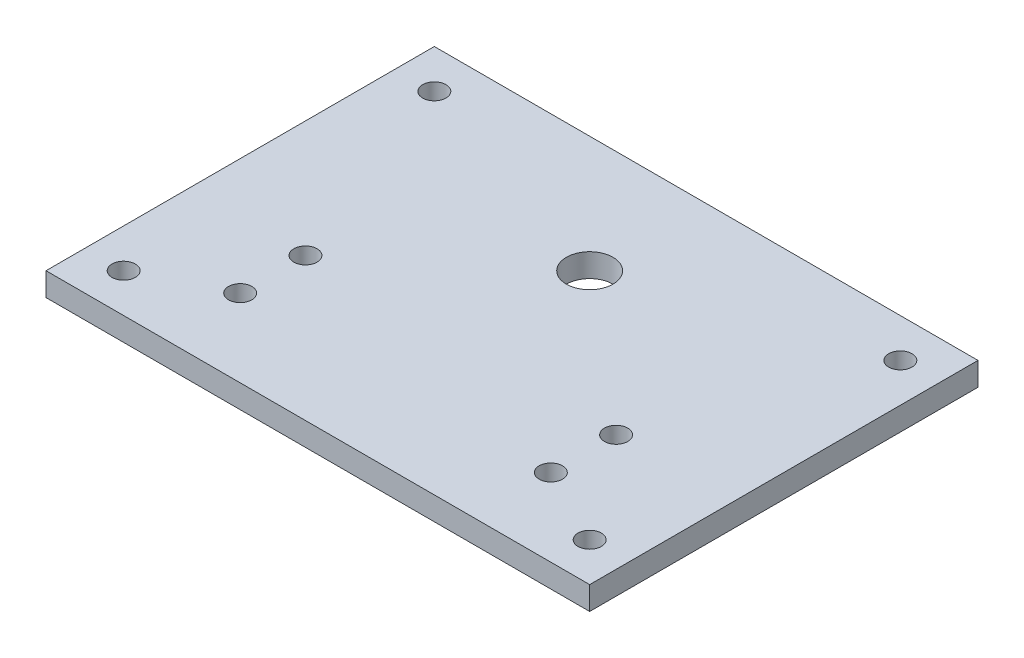
ISO-10303-21;
HEADER;
FILE_DESCRIPTION(('STEP AP214'),'2;1');
FILE_NAME('part.step','',(''),(''),'','','');
FILE_SCHEMA(('AUTOMOTIVE_DESIGN { 1 0 10303 214 1 1 1 1 }'));
ENDSEC;
DATA;
#1=APPLICATION_CONTEXT('core data for automotive mechanical design processes');
#2=APPLICATION_PROTOCOL_DEFINITION('international standard','automotive_design',2000,#1);
#3=PRODUCT_CONTEXT('',#1,'mechanical');
#4=PRODUCT('Part','Part','',(#3));
#5=PRODUCT_RELATED_PRODUCT_CATEGORY('part','',(#4));
#6=PRODUCT_DEFINITION_FORMATION('','',#4);
#7=PRODUCT_DEFINITION_CONTEXT('part definition',#1,'design');
#8=PRODUCT_DEFINITION('design','',#6,#7);
#9=PRODUCT_DEFINITION_SHAPE('','',#8);
#10=(LENGTH_UNIT() NAMED_UNIT(*) SI_UNIT(.MILLI.,.METRE.));
#11=(NAMED_UNIT(*) PLANE_ANGLE_UNIT() SI_UNIT($,.RADIAN.));
#12=(NAMED_UNIT(*) SI_UNIT($,.STERADIAN.) SOLID_ANGLE_UNIT());
#13=UNCERTAINTY_MEASURE_WITH_UNIT(LENGTH_MEASURE(1.E-05),#10,'distance_accuracy_value','');
#14=(GEOMETRIC_REPRESENTATION_CONTEXT(3) GLOBAL_UNCERTAINTY_ASSIGNED_CONTEXT((#13)) GLOBAL_UNIT_ASSIGNED_CONTEXT((#10,
#11,#12)) REPRESENTATION_CONTEXT('',''));
#15=CARTESIAN_POINT('',(0.,0.,0.));
#16=DIRECTION('',(0.,0.,1.));
#17=DIRECTION('',(1.,0.,0.));
#18=AXIS2_PLACEMENT_3D('',#15,#16,#17);
#19=CARTESIAN_POINT('',(70.,205.,132.65));
#20=DIRECTION('',(0.,0.,-1.));
#21=DIRECTION('',(-1.,0.,0.));
#22=AXIS2_PLACEMENT_3D('',#19,#20,#21);
#23=PLANE('',#22);
#24=DIRECTION('',(-1.,0.,0.));
#25=VECTOR('',#24,1.);
#26=CARTESIAN_POINT('',(70.,205.,132.65));
#27=LINE('',#26,#25);
#28=CARTESIAN_POINT('',(70.,205.,132.65));
#29=VERTEX_POINT('',#28);
#30=CARTESIAN_POINT('',(-70.,205.,132.65));
#31=VERTEX_POINT('',#30);
#32=EDGE_CURVE('E104',#29,#31,#27,.T.);
#33=ORIENTED_EDGE('',*,*,#32,.T.);
#34=DIRECTION('',(0.,-1.,0.));
#35=VECTOR('',#34,1.);
#36=CARTESIAN_POINT('',(-70.,205.,132.65));
#37=LINE('',#36,#35);
#38=CARTESIAN_POINT('',(-70.,199.,132.65));
#39=VERTEX_POINT('',#38);
#40=EDGE_CURVE('E98',#31,#39,#37,.T.);
#41=ORIENTED_EDGE('',*,*,#40,.T.);
#42=DIRECTION('',(-1.,0.,0.));
#43=VECTOR('',#42,1.);
#44=CARTESIAN_POINT('',(70.,199.,132.65));
#45=LINE('',#44,#43);
#46=CARTESIAN_POINT('',(70.,199.,132.65));
#47=VERTEX_POINT('',#46);
#48=EDGE_CURVE('E11',#47,#39,#45,.T.);
#49=ORIENTED_EDGE('',*,*,#48,.F.);
#50=DIRECTION('',(0.,-1.,0.));
#51=VECTOR('',#50,1.);
#52=CARTESIAN_POINT('',(70.,205.,132.65));
#53=LINE('',#52,#51);
#54=EDGE_CURVE('E120',#29,#47,#53,.T.);
#55=ORIENTED_EDGE('',*,*,#54,.F.);
#56=EDGE_LOOP('',(#33,#41,#49,#55));
#57=FACE_BOUND('',#56,.T.);
#58=ADVANCED_FACE('F45',(#57),#23,.F.);
#59=CARTESIAN_POINT('',(70.,199.,132.65));
#60=DIRECTION('',(0.,1.,0.));
#61=DIRECTION('',(0.,0.,1.));
#62=AXIS2_PLACEMENT_3D('',#59,#60,#61);
#63=PLANE('',#62);
#64=CARTESIAN_POINT('',(-60.,199.,122.65));
#65=DIRECTION('',(0.,1.,0.));
#66=DIRECTION('',(0.,0.,1.));
#67=AXIS2_PLACEMENT_3D('',#64,#65,#66);
#68=CIRCLE('',#67,3.00000000000001);
#69=CARTESIAN_POINT('',(-60.,199.,125.65));
#70=VERTEX_POINT('',#69);
#71=EDGE_CURVE('E163',#70,#70,#68,.F.);
#72=ORIENTED_EDGE('',*,*,#71,.F.);
#73=EDGE_LOOP('',(#72));
#74=FACE_BOUND('',#73,.T.);
#75=CARTESIAN_POINT('',(60.,199.,122.65));
#76=DIRECTION('',(0.,1.,0.));
#77=DIRECTION('',(0.,0.,1.));
#78=AXIS2_PLACEMENT_3D('',#75,#76,#77);
#79=CIRCLE('',#78,3.);
#80=CARTESIAN_POINT('',(60.,199.,125.65));
#81=VERTEX_POINT('',#80);
#82=EDGE_CURVE('E167',#81,#81,#79,.F.);
#83=ORIENTED_EDGE('',*,*,#82,.F.);
#84=EDGE_LOOP('',(#83));
#85=FACE_BOUND('',#84,.T.);
#86=CARTESIAN_POINT('',(60.,199.,42.65));
#87=DIRECTION('',(0.,1.,0.));
#88=DIRECTION('',(0.,0.,1.));
#89=AXIS2_PLACEMENT_3D('',#86,#87,#88);
#90=CIRCLE('',#89,2.99999999999999);
#91=CARTESIAN_POINT('',(60.,199.,45.65));
#92=VERTEX_POINT('',#91);
#93=EDGE_CURVE('E171',#92,#92,#90,.F.);
#94=ORIENTED_EDGE('',*,*,#93,.F.);
#95=EDGE_LOOP('',(#94));
#96=FACE_BOUND('',#95,.T.);
#97=CARTESIAN_POINT('',(-60.,199.,42.65));
#98=DIRECTION('',(0.,1.,0.));
#99=DIRECTION('',(0.,0.,1.));
#100=AXIS2_PLACEMENT_3D('',#97,#98,#99);
#101=CIRCLE('',#100,2.99999999999999);
#102=CARTESIAN_POINT('',(-60.,199.,45.65));
#103=VERTEX_POINT('',#102);
#104=EDGE_CURVE('E175',#103,#103,#101,.F.);
#105=ORIENTED_EDGE('',*,*,#104,.F.);
#106=EDGE_LOOP('',(#105));
#107=FACE_BOUND('',#106,.T.);
#108=CARTESIAN_POINT('',(0.,199.,62.65));
#109=DIRECTION('',(0.,1.,0.));
#110=DIRECTION('',(0.,0.,1.));
#111=AXIS2_PLACEMENT_3D('',#108,#109,#110);
#112=CIRCLE('',#111,6.);
#113=CARTESIAN_POINT('',(0.,199.,56.65));
#114=VERTEX_POINT('',#113);
#115=EDGE_CURVE('E106',#114,#114,#112,.F.);
#116=ORIENTED_EDGE('',*,*,#115,.F.);
#117=EDGE_LOOP('',(#116));
#118=FACE_BOUND('',#117,.T.);
#119=CARTESIAN_POINT('',(-40.,199.,112.65));
#120=DIRECTION('',(0.,1.,0.));
#121=DIRECTION('',(0.,0.,1.));
#122=AXIS2_PLACEMENT_3D('',#119,#120,#121);
#123=CIRCLE('',#122,3.);
#124=CARTESIAN_POINT('',(-40.,199.,109.65));
#125=VERTEX_POINT('',#124);
#126=EDGE_CURVE('E111',#125,#125,#123,.F.);
#127=ORIENTED_EDGE('',*,*,#126,.F.);
#128=EDGE_LOOP('',(#127));
#129=FACE_BOUND('',#128,.T.);
#130=CARTESIAN_POINT('',(-40.,199.,95.8393194373977));
#131=DIRECTION('',(0.,1.,0.));
#132=DIRECTION('',(0.,0.,1.));
#133=AXIS2_PLACEMENT_3D('',#130,#131,#132);
#134=CIRCLE('',#133,3.);
#135=CARTESIAN_POINT('',(-40.,199.,92.8393194373977));
#136=VERTEX_POINT('',#135);
#137=EDGE_CURVE('E184',#136,#136,#134,.F.);
#138=ORIENTED_EDGE('',*,*,#137,.F.);
#139=EDGE_LOOP('',(#138));
#140=FACE_BOUND('',#139,.T.);
#141=CARTESIAN_POINT('',(40.,199.,95.8393194373977));
#142=DIRECTION('',(0.,1.,0.));
#143=DIRECTION('',(0.,0.,1.));
#144=AXIS2_PLACEMENT_3D('',#141,#142,#143);
#145=CIRCLE('',#144,3.);
#146=CARTESIAN_POINT('',(40.,199.,92.8393194373977));
#147=VERTEX_POINT('',#146);
#148=EDGE_CURVE('E188',#147,#147,#145,.F.);
#149=ORIENTED_EDGE('',*,*,#148,.F.);
#150=EDGE_LOOP('',(#149));
#151=FACE_BOUND('',#150,.T.);
#152=CARTESIAN_POINT('',(40.,199.,112.65));
#153=DIRECTION('',(0.,1.,0.));
#154=DIRECTION('',(0.,0.,1.));
#155=AXIS2_PLACEMENT_3D('',#152,#153,#154);
#156=CIRCLE('',#155,3.);
#157=CARTESIAN_POINT('',(40.,199.,109.65));
#158=VERTEX_POINT('',#157);
#159=EDGE_CURVE('E191',#158,#158,#156,.F.);
#160=ORIENTED_EDGE('',*,*,#159,.F.);
#161=EDGE_LOOP('',(#160));
#162=FACE_BOUND('',#161,.T.);
#163=ORIENTED_EDGE('',*,*,#48,.T.);
#164=DIRECTION('',(0.,0.,-1.));
#165=VECTOR('',#164,1.);
#166=CARTESIAN_POINT('',(-70.,199.,132.65));
#167=LINE('',#166,#165);
#168=CARTESIAN_POINT('',(-70.,199.,32.65));
#169=VERTEX_POINT('',#168);
#170=EDGE_CURVE('E88',#39,#169,#167,.T.);
#171=ORIENTED_EDGE('',*,*,#170,.T.);
#172=DIRECTION('',(-1.,0.,0.));
#173=VECTOR('',#172,1.);
#174=CARTESIAN_POINT('',(70.,199.,32.65));
#175=LINE('',#174,#173);
#176=CARTESIAN_POINT('',(70.,199.,32.65));
#177=VERTEX_POINT('',#176);
#178=EDGE_CURVE('E53',#177,#169,#175,.T.);
#179=ORIENTED_EDGE('',*,*,#178,.F.);
#180=DIRECTION('',(0.,0.,-1.));
#181=VECTOR('',#180,1.);
#182=CARTESIAN_POINT('',(70.,199.,132.65));
#183=LINE('',#182,#181);
#184=EDGE_CURVE('E89',#47,#177,#183,.T.);
#185=ORIENTED_EDGE('',*,*,#184,.F.);
#186=EDGE_LOOP('',(#163,#171,#179,#185));
#187=FACE_BOUND('',#186,.T.);
#188=ADVANCED_FACE('F86',(#74,#85,#96,#107,#118,#129,#140,#151,#162,#187),#63,.F.);
#189=CARTESIAN_POINT('',(70.,205.,32.65));
#190=DIRECTION('',(0.,0.,1.));
#191=DIRECTION('',(1.,0.,0.));
#192=AXIS2_PLACEMENT_3D('',#189,#190,#191);
#193=PLANE('',#192);
#194=ORIENTED_EDGE('',*,*,#178,.T.);
#195=DIRECTION('',(0.,1.,0.));
#196=VECTOR('',#195,1.);
#197=CARTESIAN_POINT('',(-70.,205.,32.65));
#198=LINE('',#197,#196);
#199=CARTESIAN_POINT('',(-70.,205.,32.65));
#200=VERTEX_POINT('',#199);
#201=EDGE_CURVE('E101',#169,#200,#198,.T.);
#202=ORIENTED_EDGE('',*,*,#201,.T.);
#203=DIRECTION('',(-1.,0.,0.));
#204=VECTOR('',#203,1.);
#205=CARTESIAN_POINT('',(70.,205.,32.65));
#206=LINE('',#205,#204);
#207=CARTESIAN_POINT('',(70.,205.,32.65));
#208=VERTEX_POINT('',#207);
#209=EDGE_CURVE('E131',#208,#200,#206,.T.);
#210=ORIENTED_EDGE('',*,*,#209,.F.);
#211=DIRECTION('',(0.,1.,0.));
#212=VECTOR('',#211,1.);
#213=CARTESIAN_POINT('',(70.,205.,32.65));
#214=LINE('',#213,#212);
#215=EDGE_CURVE('E65',#177,#208,#214,.T.);
#216=ORIENTED_EDGE('',*,*,#215,.F.);
#217=EDGE_LOOP('',(#194,#202,#210,#216));
#218=FACE_BOUND('',#217,.T.);
#219=ADVANCED_FACE('F136',(#218),#193,.F.);
#220=CARTESIAN_POINT('',(70.,205.,132.65));
#221=DIRECTION('',(0.,-1.,0.));
#222=DIRECTION('',(0.,0.,-1.));
#223=AXIS2_PLACEMENT_3D('',#220,#221,#222);
#224=PLANE('',#223);
#225=CARTESIAN_POINT('',(-60.,205.,122.65));
#226=DIRECTION('',(0.,-1.,0.));
#227=DIRECTION('',(0.,0.,-1.));
#228=AXIS2_PLACEMENT_3D('',#225,#226,#227);
#229=CIRCLE('',#228,3.00000000000001);
#230=CARTESIAN_POINT('',(-60.,205.,119.65));
#231=VERTEX_POINT('',#230);
#232=EDGE_CURVE('E278',#231,#231,#229,.T.);
#233=ORIENTED_EDGE('',*,*,#232,.T.);
#234=EDGE_LOOP('',(#233));
#235=FACE_BOUND('',#234,.T.);
#236=CARTESIAN_POINT('',(60.,205.,122.65));
#237=DIRECTION('',(0.,-1.,0.));
#238=DIRECTION('',(0.,0.,-1.));
#239=AXIS2_PLACEMENT_3D('',#236,#237,#238);
#240=CIRCLE('',#239,3.);
#241=CARTESIAN_POINT('',(60.,205.,119.65));
#242=VERTEX_POINT('',#241);
#243=EDGE_CURVE('E282',#242,#242,#240,.T.);
#244=ORIENTED_EDGE('',*,*,#243,.T.);
#245=EDGE_LOOP('',(#244));
#246=FACE_BOUND('',#245,.T.);
#247=CARTESIAN_POINT('',(60.,205.,42.65));
#248=DIRECTION('',(0.,-1.,0.));
#249=DIRECTION('',(0.,0.,-1.));
#250=AXIS2_PLACEMENT_3D('',#247,#248,#249);
#251=CIRCLE('',#250,2.99999999999999);
#252=CARTESIAN_POINT('',(60.,205.,39.6500000000001));
#253=VERTEX_POINT('',#252);
#254=EDGE_CURVE('E277',#253,#253,#251,.T.);
#255=ORIENTED_EDGE('',*,*,#254,.T.);
#256=EDGE_LOOP('',(#255));
#257=FACE_BOUND('',#256,.T.);
#258=CARTESIAN_POINT('',(-60.,205.,42.65));
#259=DIRECTION('',(0.,-1.,0.));
#260=DIRECTION('',(0.,0.,-1.));
#261=AXIS2_PLACEMENT_3D('',#258,#259,#260);
#262=CIRCLE('',#261,2.99999999999999);
#263=CARTESIAN_POINT('',(-60.,205.,39.65));
#264=VERTEX_POINT('',#263);
#265=EDGE_CURVE('E273',#264,#264,#262,.T.);
#266=ORIENTED_EDGE('',*,*,#265,.T.);
#267=EDGE_LOOP('',(#266));
#268=FACE_BOUND('',#267,.T.);
#269=CARTESIAN_POINT('',(0.,205.,62.65));
#270=DIRECTION('',(0.,-1.,0.));
#271=DIRECTION('',(0.,0.,-1.));
#272=AXIS2_PLACEMENT_3D('',#269,#270,#271);
#273=CIRCLE('',#272,6.);
#274=CARTESIAN_POINT('',(0.,205.,56.65));
#275=VERTEX_POINT('',#274);
#276=EDGE_CURVE('E194',#275,#275,#273,.T.);
#277=ORIENTED_EDGE('',*,*,#276,.T.);
#278=EDGE_LOOP('',(#277));
#279=FACE_BOUND('',#278,.T.);
#280=CARTESIAN_POINT('',(-40.,205.,112.65));
#281=DIRECTION('',(0.,-1.,0.));
#282=DIRECTION('',(0.,0.,-1.));
#283=AXIS2_PLACEMENT_3D('',#280,#281,#282);
#284=CIRCLE('',#283,3.);
#285=CARTESIAN_POINT('',(-40.,205.,109.65));
#286=VERTEX_POINT('',#285);
#287=EDGE_CURVE('E201',#286,#286,#284,.T.);
#288=ORIENTED_EDGE('',*,*,#287,.T.);
#289=EDGE_LOOP('',(#288));
#290=FACE_BOUND('',#289,.T.);
#291=CARTESIAN_POINT('',(-40.,205.,95.8393194373977));
#292=DIRECTION('',(0.,-1.,0.));
#293=DIRECTION('',(0.,0.,-1.));
#294=AXIS2_PLACEMENT_3D('',#291,#292,#293);
#295=CIRCLE('',#294,3.);
#296=CARTESIAN_POINT('',(-40.,205.,92.8393194373977));
#297=VERTEX_POINT('',#296);
#298=EDGE_CURVE('E245',#297,#297,#295,.T.);
#299=ORIENTED_EDGE('',*,*,#298,.T.);
#300=EDGE_LOOP('',(#299));
#301=FACE_BOUND('',#300,.T.);
#302=CARTESIAN_POINT('',(40.,205.,95.8393194373977));
#303=DIRECTION('',(0.,-1.,0.));
#304=DIRECTION('',(0.,0.,-1.));
#305=AXIS2_PLACEMENT_3D('',#302,#303,#304);
#306=CIRCLE('',#305,3.);
#307=CARTESIAN_POINT('',(40.,205.,92.8393194373977));
#308=VERTEX_POINT('',#307);
#309=EDGE_CURVE('E240',#308,#308,#306,.T.);
#310=ORIENTED_EDGE('',*,*,#309,.T.);
#311=EDGE_LOOP('',(#310));
#312=FACE_BOUND('',#311,.T.);
#313=CARTESIAN_POINT('',(40.,205.,112.65));
#314=DIRECTION('',(0.,-1.,0.));
#315=DIRECTION('',(0.,0.,-1.));
#316=AXIS2_PLACEMENT_3D('',#313,#314,#315);
#317=CIRCLE('',#316,3.);
#318=CARTESIAN_POINT('',(40.,205.,109.65));
#319=VERTEX_POINT('',#318);
#320=EDGE_CURVE('E204',#319,#319,#317,.T.);
#321=ORIENTED_EDGE('',*,*,#320,.T.);
#322=EDGE_LOOP('',(#321));
#323=FACE_BOUND('',#322,.T.);
#324=ORIENTED_EDGE('',*,*,#209,.T.);
#325=DIRECTION('',(0.,0.,1.));
#326=VECTOR('',#325,1.);
#327=CARTESIAN_POINT('',(-70.,205.,132.65));
#328=LINE('',#327,#326);
#329=EDGE_CURVE('E117',#200,#31,#328,.T.);
#330=ORIENTED_EDGE('',*,*,#329,.T.);
#331=ORIENTED_EDGE('',*,*,#32,.F.);
#332=DIRECTION('',(0.,0.,1.));
#333=VECTOR('',#332,1.);
#334=CARTESIAN_POINT('',(70.,205.,132.65));
#335=LINE('',#334,#333);
#336=EDGE_CURVE('E60',#208,#29,#335,.T.);
#337=ORIENTED_EDGE('',*,*,#336,.F.);
#338=EDGE_LOOP('',(#324,#330,#331,#337));
#339=FACE_BOUND('',#338,.T.);
#340=ADVANCED_FACE('F138',(#235,#246,#257,#268,#279,#290,#301,#312,#323,#339),#224,.F.);
#341=CARTESIAN_POINT('',(70.,0.,0.));
#342=DIRECTION('',(1.,0.,0.));
#343=DIRECTION('',(0.,0.,-1.));
#344=AXIS2_PLACEMENT_3D('',#341,#342,#343);
#345=PLANE('',#344);
#346=ORIENTED_EDGE('',*,*,#54,.T.);
#347=ORIENTED_EDGE('',*,*,#184,.T.);
#348=ORIENTED_EDGE('',*,*,#215,.T.);
#349=ORIENTED_EDGE('',*,*,#336,.T.);
#350=EDGE_LOOP('',(#346,#347,#348,#349));
#351=FACE_BOUND('',#350,.T.);
#352=ADVANCED_FACE('F139',(#351),#345,.T.);
#353=CARTESIAN_POINT('',(-70.,0.,0.));
#354=DIRECTION('',(1.,0.,0.));
#355=DIRECTION('',(0.,0.,-1.));
#356=AXIS2_PLACEMENT_3D('',#353,#354,#355);
#357=PLANE('',#356);
#358=ORIENTED_EDGE('',*,*,#40,.F.);
#359=ORIENTED_EDGE('',*,*,#329,.F.);
#360=ORIENTED_EDGE('',*,*,#201,.F.);
#361=ORIENTED_EDGE('',*,*,#170,.F.);
#362=EDGE_LOOP('',(#358,#359,#360,#361));
#363=FACE_BOUND('',#362,.T.);
#364=ADVANCED_FACE('F96',(#363),#357,.F.);
#365=CARTESIAN_POINT('',(40.,221.970562748477,112.65));
#366=DIRECTION('',(0.,-1.,0.));
#367=DIRECTION('',(0.,0.,-1.));
#368=AXIS2_PLACEMENT_3D('',#365,#366,#367);
#369=CYLINDRICAL_SURFACE('',#368,3.);
#370=CARTESIAN_POINT('',(40.,205.,109.65));
#371=CARTESIAN_POINT('',(40.,204.9375,109.65));
#372=CARTESIAN_POINT('',(40.,204.875,109.65));
#373=CARTESIAN_POINT('',(40.,204.75,109.65));
#374=CARTESIAN_POINT('',(40.,204.6875,109.65));
#375=CARTESIAN_POINT('',(40.,204.5625,109.65));
#376=CARTESIAN_POINT('',(40.,204.5,109.65));
#377=CARTESIAN_POINT('',(40.,204.375,109.65));
#378=CARTESIAN_POINT('',(40.,204.3125,109.65));
#379=CARTESIAN_POINT('',(40.,204.1875,109.65));
#380=CARTESIAN_POINT('',(40.,204.125,109.65));
#381=CARTESIAN_POINT('',(40.,204.,109.65));
#382=CARTESIAN_POINT('',(40.,203.9375,109.65));
#383=CARTESIAN_POINT('',(40.,203.8125,109.65));
#384=CARTESIAN_POINT('',(40.,203.75,109.65));
#385=CARTESIAN_POINT('',(40.,203.625,109.65));
#386=CARTESIAN_POINT('',(40.,203.5625,109.65));
#387=CARTESIAN_POINT('',(40.,203.4375,109.65));
#388=CARTESIAN_POINT('',(40.,203.375,109.65));
#389=CARTESIAN_POINT('',(40.,203.25,109.65));
#390=CARTESIAN_POINT('',(40.,203.1875,109.65));
#391=CARTESIAN_POINT('',(40.,203.0625,109.65));
#392=CARTESIAN_POINT('',(40.,203.,109.65));
#393=CARTESIAN_POINT('',(40.,202.875,109.65));
#394=CARTESIAN_POINT('',(40.,202.8125,109.65));
#395=CARTESIAN_POINT('',(40.,202.6875,109.65));
#396=CARTESIAN_POINT('',(40.,202.625,109.65));
#397=CARTESIAN_POINT('',(40.,202.5,109.65));
#398=CARTESIAN_POINT('',(40.,202.4375,109.65));
#399=CARTESIAN_POINT('',(40.,202.3125,109.65));
#400=CARTESIAN_POINT('',(40.,202.25,109.65));
#401=CARTESIAN_POINT('',(40.,202.125,109.65));
#402=CARTESIAN_POINT('',(40.,202.0625,109.65));
#403=CARTESIAN_POINT('',(40.,201.9375,109.65));
#404=CARTESIAN_POINT('',(40.,201.875,109.65));
#405=CARTESIAN_POINT('',(40.,201.75,109.65));
#406=CARTESIAN_POINT('',(40.,201.6875,109.65));
#407=CARTESIAN_POINT('',(40.,201.5625,109.65));
#408=CARTESIAN_POINT('',(40.,201.5,109.65));
#409=CARTESIAN_POINT('',(40.,201.375,109.65));
#410=CARTESIAN_POINT('',(40.,201.3125,109.65));
#411=CARTESIAN_POINT('',(40.,201.1875,109.65));
#412=CARTESIAN_POINT('',(40.,201.125,109.65));
#413=CARTESIAN_POINT('',(40.,201.,109.65));
#414=CARTESIAN_POINT('',(40.,200.9375,109.65));
#415=CARTESIAN_POINT('',(40.,200.8125,109.65));
#416=CARTESIAN_POINT('',(40.,200.75,109.65));
#417=CARTESIAN_POINT('',(40.,200.625,109.65));
#418=CARTESIAN_POINT('',(40.,200.5625,109.65));
#419=CARTESIAN_POINT('',(40.,200.4375,109.65));
#420=CARTESIAN_POINT('',(40.,200.375,109.65));
#421=CARTESIAN_POINT('',(40.,200.25,109.65));
#422=CARTESIAN_POINT('',(40.,200.1875,109.65));
#423=CARTESIAN_POINT('',(40.,200.0625,109.65));
#424=CARTESIAN_POINT('',(40.,200.,109.65));
#425=CARTESIAN_POINT('',(40.,199.875,109.65));
#426=CARTESIAN_POINT('',(40.,199.8125,109.65));
#427=CARTESIAN_POINT('',(40.,199.6875,109.65));
#428=CARTESIAN_POINT('',(40.,199.625,109.65));
#429=CARTESIAN_POINT('',(40.,199.5,109.65));
#430=CARTESIAN_POINT('',(40.,199.4375,109.65));
#431=CARTESIAN_POINT('',(40.,199.3125,109.65));
#432=CARTESIAN_POINT('',(40.,199.25,109.65));
#433=CARTESIAN_POINT('',(40.,199.125,109.65));
#434=CARTESIAN_POINT('',(40.,199.0625,109.65));
#435=CARTESIAN_POINT('',(40.,199.,109.65));
#436=B_SPLINE_CURVE_WITH_KNOTS('',3,(#370,#371,#372,#373,#374,#375,#376,#377,#378,#379,#380,
#381,#382,#383,#384,#385,#386,#387,#388,#389,#390,#391,#392,#393,#394,#395,#396,#397,#398,#399,
#400,#401,#402,#403,#404,#405,#406,#407,#408,#409,#410,#411,#412,#413,#414,#415,#416,#417,#418,
#419,#420,#421,#422,#423,#424,#425,#426,#427,#428,#429,#430,#431,#432,#433,#434,#435),
.UNSPECIFIED.,.F.,.F.,(4,2,2,2,2,2,2,2,2,2,2,2,2,2,2,2,2,2,2,2,2,2,2,2,2,2,2,2,2,2,2,2,4),(0.,
0.187500000000007,0.375000000000014,0.562500000000021,0.750000000000001,0.937500000000008,
1.12500000000001,1.31250000000002,1.50000000000003,1.68750000000004,1.87500000000002,
2.06250000000002,2.25000000000003,2.43750000000004,2.62500000000002,2.81250000000002,
3.00000000000003,3.18750000000004,3.37500000000004,3.56250000000002,3.75000000000003,
3.93750000000004,4.12500000000005,4.31250000000002,4.50000000000003,4.68750000000004,
4.87500000000005,5.06250000000005,5.25000000000006,5.43750000000004,5.62500000000005,
5.81250000000005,6.00000000000006),.UNSPECIFIED.);
#437=EDGE_CURVE('BSEAM146',#319,#158,#436,.T.);
#438=ORIENTED_EDGE('',*,*,#320,.F.);
#439=ORIENTED_EDGE('',*,*,#159,.T.);
#440=ORIENTED_EDGE('',*,*,#437,.T.);
#441=ORIENTED_EDGE('',*,*,#437,.F.);
#442=EDGE_LOOP('',(#438,#440,#439,#441));
#443=FACE_BOUND('',#442,.T.);
#444=ADVANCED_FACE('F146',(#443),#369,.F.);
#445=CARTESIAN_POINT('',(40.,221.970562748477,95.8393194373977));
#446=DIRECTION('',(0.,-1.,0.));
#447=DIRECTION('',(0.,0.,-1.));
#448=AXIS2_PLACEMENT_3D('',#445,#446,#447);
#449=CYLINDRICAL_SURFACE('',#448,3.);
#450=CARTESIAN_POINT('',(40.,205.,92.8393194373977));
#451=CARTESIAN_POINT('',(40.,204.9375,92.8393194373977));
#452=CARTESIAN_POINT('',(40.,204.875,92.8393194373977));
#453=CARTESIAN_POINT('',(40.,204.75,92.8393194373977));
#454=CARTESIAN_POINT('',(40.,204.6875,92.8393194373977));
#455=CARTESIAN_POINT('',(40.,204.5625,92.8393194373977));
#456=CARTESIAN_POINT('',(40.,204.5,92.8393194373977));
#457=CARTESIAN_POINT('',(40.,204.375,92.8393194373977));
#458=CARTESIAN_POINT('',(40.,204.3125,92.8393194373977));
#459=CARTESIAN_POINT('',(40.,204.1875,92.8393194373977));
#460=CARTESIAN_POINT('',(40.,204.125,92.8393194373977));
#461=CARTESIAN_POINT('',(40.,204.,92.8393194373977));
#462=CARTESIAN_POINT('',(40.,203.9375,92.8393194373977));
#463=CARTESIAN_POINT('',(40.,203.8125,92.8393194373977));
#464=CARTESIAN_POINT('',(40.,203.75,92.8393194373977));
#465=CARTESIAN_POINT('',(40.,203.625,92.8393194373977));
#466=CARTESIAN_POINT('',(40.,203.5625,92.8393194373977));
#467=CARTESIAN_POINT('',(40.,203.4375,92.8393194373977));
#468=CARTESIAN_POINT('',(40.,203.375,92.8393194373977));
#469=CARTESIAN_POINT('',(40.,203.25,92.8393194373977));
#470=CARTESIAN_POINT('',(40.,203.1875,92.8393194373977));
#471=CARTESIAN_POINT('',(40.,203.0625,92.8393194373977));
#472=CARTESIAN_POINT('',(40.,203.,92.8393194373977));
#473=CARTESIAN_POINT('',(40.,202.875,92.8393194373977));
#474=CARTESIAN_POINT('',(40.,202.8125,92.8393194373977));
#475=CARTESIAN_POINT('',(40.,202.6875,92.8393194373977));
#476=CARTESIAN_POINT('',(40.,202.625,92.8393194373977));
#477=CARTESIAN_POINT('',(40.,202.5,92.8393194373977));
#478=CARTESIAN_POINT('',(40.,202.4375,92.8393194373977));
#479=CARTESIAN_POINT('',(40.,202.3125,92.8393194373977));
#480=CARTESIAN_POINT('',(40.,202.25,92.8393194373977));
#481=CARTESIAN_POINT('',(40.,202.125,92.8393194373977));
#482=CARTESIAN_POINT('',(40.,202.0625,92.8393194373977));
#483=CARTESIAN_POINT('',(40.,201.9375,92.8393194373977));
#484=CARTESIAN_POINT('',(40.,201.875,92.8393194373977));
#485=CARTESIAN_POINT('',(40.,201.75,92.8393194373977));
#486=CARTESIAN_POINT('',(40.,201.6875,92.8393194373977));
#487=CARTESIAN_POINT('',(40.,201.5625,92.8393194373977));
#488=CARTESIAN_POINT('',(40.,201.5,92.8393194373977));
#489=CARTESIAN_POINT('',(40.,201.375,92.8393194373977));
#490=CARTESIAN_POINT('',(40.,201.3125,92.8393194373977));
#491=CARTESIAN_POINT('',(40.,201.1875,92.8393194373977));
#492=CARTESIAN_POINT('',(40.,201.125,92.8393194373977));
#493=CARTESIAN_POINT('',(40.,201.,92.8393194373977));
#494=CARTESIAN_POINT('',(40.,200.9375,92.8393194373977));
#495=CARTESIAN_POINT('',(40.,200.8125,92.8393194373977));
#496=CARTESIAN_POINT('',(40.,200.75,92.8393194373977));
#497=CARTESIAN_POINT('',(40.,200.625,92.8393194373977));
#498=CARTESIAN_POINT('',(40.,200.5625,92.8393194373977));
#499=CARTESIAN_POINT('',(40.,200.4375,92.8393194373977));
#500=CARTESIAN_POINT('',(40.,200.375,92.8393194373977));
#501=CARTESIAN_POINT('',(40.,200.25,92.8393194373977));
#502=CARTESIAN_POINT('',(40.,200.1875,92.8393194373977));
#503=CARTESIAN_POINT('',(40.,200.0625,92.8393194373977));
#504=CARTESIAN_POINT('',(40.,200.,92.8393194373977));
#505=CARTESIAN_POINT('',(40.,199.875,92.8393194373977));
#506=CARTESIAN_POINT('',(40.,199.8125,92.8393194373977));
#507=CARTESIAN_POINT('',(40.,199.6875,92.8393194373977));
#508=CARTESIAN_POINT('',(40.,199.625,92.8393194373977));
#509=CARTESIAN_POINT('',(40.,199.5,92.8393194373977));
#510=CARTESIAN_POINT('',(40.,199.4375,92.8393194373977));
#511=CARTESIAN_POINT('',(40.,199.3125,92.8393194373977));
#512=CARTESIAN_POINT('',(40.,199.25,92.8393194373977));
#513=CARTESIAN_POINT('',(40.,199.125,92.8393194373977));
#514=CARTESIAN_POINT('',(40.,199.0625,92.8393194373977));
#515=CARTESIAN_POINT('',(40.,199.,92.8393194373977));
#516=B_SPLINE_CURVE_WITH_KNOTS('',3,(#450,#451,#452,#453,#454,#455,#456,#457,#458,#459,#460,
#461,#462,#463,#464,#465,#466,#467,#468,#469,#470,#471,#472,#473,#474,#475,#476,#477,#478,#479,
#480,#481,#482,#483,#484,#485,#486,#487,#488,#489,#490,#491,#492,#493,#494,#495,#496,#497,#498,
#499,#500,#501,#502,#503,#504,#505,#506,#507,#508,#509,#510,#511,#512,#513,#514,#515),
.UNSPECIFIED.,.F.,.F.,(4,2,2,2,2,2,2,2,2,2,2,2,2,2,2,2,2,2,2,2,2,2,2,2,2,2,2,2,2,2,2,2,4),(0.,
0.187500000000007,0.375000000000014,0.562500000000021,0.750000000000001,0.937500000000008,
1.12500000000001,1.31250000000002,1.50000000000003,1.68750000000004,1.87500000000002,
2.06250000000002,2.25000000000003,2.43750000000004,2.62500000000002,2.81250000000002,
3.00000000000003,3.18750000000004,3.37500000000004,3.56250000000002,3.75000000000003,
3.93750000000004,4.12500000000005,4.31250000000002,4.50000000000003,4.68750000000004,
4.87500000000005,5.06250000000005,5.25000000000006,5.43750000000004,5.62500000000005,
5.81250000000005,6.00000000000006),.UNSPECIFIED.);
#517=EDGE_CURVE('BSEAM223',#308,#147,#516,.T.);
#518=ORIENTED_EDGE('',*,*,#309,.F.);
#519=ORIENTED_EDGE('',*,*,#148,.T.);
#520=ORIENTED_EDGE('',*,*,#517,.T.);
#521=ORIENTED_EDGE('',*,*,#517,.F.);
#522=EDGE_LOOP('',(#518,#520,#519,#521));
#523=FACE_BOUND('',#522,.T.);
#524=ADVANCED_FACE('F223',(#523),#449,.F.);
#525=CARTESIAN_POINT('',(-40.,221.970562748477,95.8393194373977));
#526=DIRECTION('',(0.,-1.,0.));
#527=DIRECTION('',(0.,0.,-1.));
#528=AXIS2_PLACEMENT_3D('',#525,#526,#527);
#529=CYLINDRICAL_SURFACE('',#528,3.);
#530=CARTESIAN_POINT('',(-40.,205.,92.8393194373977));
#531=CARTESIAN_POINT('',(-40.,204.9375,92.8393194373977));
#532=CARTESIAN_POINT('',(-40.,204.875,92.8393194373977));
#533=CARTESIAN_POINT('',(-40.,204.75,92.8393194373977));
#534=CARTESIAN_POINT('',(-40.,204.6875,92.8393194373977));
#535=CARTESIAN_POINT('',(-40.,204.5625,92.8393194373977));
#536=CARTESIAN_POINT('',(-40.,204.5,92.8393194373977));
#537=CARTESIAN_POINT('',(-40.,204.375,92.8393194373977));
#538=CARTESIAN_POINT('',(-40.,204.3125,92.8393194373977));
#539=CARTESIAN_POINT('',(-40.,204.1875,92.8393194373977));
#540=CARTESIAN_POINT('',(-40.,204.125,92.8393194373977));
#541=CARTESIAN_POINT('',(-40.,204.,92.8393194373977));
#542=CARTESIAN_POINT('',(-40.,203.9375,92.8393194373977));
#543=CARTESIAN_POINT('',(-40.,203.8125,92.8393194373977));
#544=CARTESIAN_POINT('',(-40.,203.75,92.8393194373977));
#545=CARTESIAN_POINT('',(-40.,203.625,92.8393194373977));
#546=CARTESIAN_POINT('',(-40.,203.5625,92.8393194373977));
#547=CARTESIAN_POINT('',(-40.,203.4375,92.8393194373977));
#548=CARTESIAN_POINT('',(-40.,203.375,92.8393194373977));
#549=CARTESIAN_POINT('',(-40.,203.25,92.8393194373977));
#550=CARTESIAN_POINT('',(-40.,203.1875,92.8393194373977));
#551=CARTESIAN_POINT('',(-40.,203.0625,92.8393194373977));
#552=CARTESIAN_POINT('',(-40.,203.,92.8393194373977));
#553=CARTESIAN_POINT('',(-40.,202.875,92.8393194373977));
#554=CARTESIAN_POINT('',(-40.,202.8125,92.8393194373977));
#555=CARTESIAN_POINT('',(-40.,202.6875,92.8393194373977));
#556=CARTESIAN_POINT('',(-40.,202.625,92.8393194373977));
#557=CARTESIAN_POINT('',(-40.,202.5,92.8393194373977));
#558=CARTESIAN_POINT('',(-40.,202.4375,92.8393194373977));
#559=CARTESIAN_POINT('',(-40.,202.3125,92.8393194373977));
#560=CARTESIAN_POINT('',(-40.,202.25,92.8393194373977));
#561=CARTESIAN_POINT('',(-40.,202.125,92.8393194373977));
#562=CARTESIAN_POINT('',(-40.,202.0625,92.8393194373977));
#563=CARTESIAN_POINT('',(-40.,201.9375,92.8393194373977));
#564=CARTESIAN_POINT('',(-40.,201.875,92.8393194373977));
#565=CARTESIAN_POINT('',(-40.,201.75,92.8393194373977));
#566=CARTESIAN_POINT('',(-40.,201.6875,92.8393194373977));
#567=CARTESIAN_POINT('',(-40.,201.5625,92.8393194373977));
#568=CARTESIAN_POINT('',(-40.,201.5,92.8393194373977));
#569=CARTESIAN_POINT('',(-40.,201.375,92.8393194373977));
#570=CARTESIAN_POINT('',(-40.,201.3125,92.8393194373977));
#571=CARTESIAN_POINT('',(-40.,201.1875,92.8393194373977));
#572=CARTESIAN_POINT('',(-40.,201.125,92.8393194373977));
#573=CARTESIAN_POINT('',(-40.,201.,92.8393194373977));
#574=CARTESIAN_POINT('',(-40.,200.9375,92.8393194373977));
#575=CARTESIAN_POINT('',(-40.,200.8125,92.8393194373977));
#576=CARTESIAN_POINT('',(-40.,200.75,92.8393194373977));
#577=CARTESIAN_POINT('',(-40.,200.625,92.8393194373977));
#578=CARTESIAN_POINT('',(-40.,200.5625,92.8393194373977));
#579=CARTESIAN_POINT('',(-40.,200.4375,92.8393194373977));
#580=CARTESIAN_POINT('',(-40.,200.375,92.8393194373977));
#581=CARTESIAN_POINT('',(-40.,200.25,92.8393194373977));
#582=CARTESIAN_POINT('',(-40.,200.1875,92.8393194373977));
#583=CARTESIAN_POINT('',(-40.,200.0625,92.8393194373977));
#584=CARTESIAN_POINT('',(-40.,200.,92.8393194373977));
#585=CARTESIAN_POINT('',(-40.,199.875,92.8393194373977));
#586=CARTESIAN_POINT('',(-40.,199.8125,92.8393194373977));
#587=CARTESIAN_POINT('',(-40.,199.6875,92.8393194373977));
#588=CARTESIAN_POINT('',(-40.,199.625,92.8393194373977));
#589=CARTESIAN_POINT('',(-40.,199.5,92.8393194373977));
#590=CARTESIAN_POINT('',(-40.,199.4375,92.8393194373977));
#591=CARTESIAN_POINT('',(-40.,199.3125,92.8393194373977));
#592=CARTESIAN_POINT('',(-40.,199.25,92.8393194373977));
#593=CARTESIAN_POINT('',(-40.,199.125,92.8393194373977));
#594=CARTESIAN_POINT('',(-40.,199.0625,92.8393194373977));
#595=CARTESIAN_POINT('',(-40.,199.,92.8393194373977));
#596=B_SPLINE_CURVE_WITH_KNOTS('',3,(#530,#531,#532,#533,#534,#535,#536,#537,#538,#539,#540,
#541,#542,#543,#544,#545,#546,#547,#548,#549,#550,#551,#552,#553,#554,#555,#556,#557,#558,#559,
#560,#561,#562,#563,#564,#565,#566,#567,#568,#569,#570,#571,#572,#573,#574,#575,#576,#577,#578,
#579,#580,#581,#582,#583,#584,#585,#586,#587,#588,#589,#590,#591,#592,#593,#594,#595),
.UNSPECIFIED.,.F.,.F.,(4,2,2,2,2,2,2,2,2,2,2,2,2,2,2,2,2,2,2,2,2,2,2,2,2,2,2,2,2,2,2,2,4),(0.,
0.187500000000007,0.375000000000014,0.562500000000021,0.750000000000001,0.937500000000008,
1.12500000000001,1.31250000000002,1.50000000000003,1.68750000000004,1.87500000000002,
2.06250000000002,2.25000000000003,2.43750000000004,2.62500000000002,2.81250000000002,
3.00000000000003,3.18750000000004,3.37500000000004,3.56250000000002,3.75000000000003,
3.93750000000004,4.12500000000005,4.31250000000002,4.50000000000003,4.68750000000004,
4.87500000000005,5.06250000000005,5.25000000000006,5.43750000000004,5.62500000000005,
5.81250000000005,6.00000000000006),.UNSPECIFIED.);
#597=EDGE_CURVE('BSEAM214',#297,#136,#596,.T.);
#598=ORIENTED_EDGE('',*,*,#298,.F.);
#599=ORIENTED_EDGE('',*,*,#137,.T.);
#600=ORIENTED_EDGE('',*,*,#597,.T.);
#601=ORIENTED_EDGE('',*,*,#597,.F.);
#602=EDGE_LOOP('',(#598,#600,#599,#601));
#603=FACE_BOUND('',#602,.T.);
#604=ADVANCED_FACE('F214',(#603),#529,.F.);
#605=CARTESIAN_POINT('',(-40.,221.970562748477,112.65));
#606=DIRECTION('',(0.,-1.,0.));
#607=DIRECTION('',(0.,0.,-1.));
#608=AXIS2_PLACEMENT_3D('',#605,#606,#607);
#609=CYLINDRICAL_SURFACE('',#608,3.);
#610=CARTESIAN_POINT('',(-40.,205.,109.65));
#611=CARTESIAN_POINT('',(-40.,204.9375,109.65));
#612=CARTESIAN_POINT('',(-40.,204.875,109.65));
#613=CARTESIAN_POINT('',(-40.,204.75,109.65));
#614=CARTESIAN_POINT('',(-40.,204.6875,109.65));
#615=CARTESIAN_POINT('',(-40.,204.5625,109.65));
#616=CARTESIAN_POINT('',(-40.,204.5,109.65));
#617=CARTESIAN_POINT('',(-40.,204.375,109.65));
#618=CARTESIAN_POINT('',(-40.,204.3125,109.65));
#619=CARTESIAN_POINT('',(-40.,204.1875,109.65));
#620=CARTESIAN_POINT('',(-40.,204.125,109.65));
#621=CARTESIAN_POINT('',(-40.,204.,109.65));
#622=CARTESIAN_POINT('',(-40.,203.9375,109.65));
#623=CARTESIAN_POINT('',(-40.,203.8125,109.65));
#624=CARTESIAN_POINT('',(-40.,203.75,109.65));
#625=CARTESIAN_POINT('',(-40.,203.625,109.65));
#626=CARTESIAN_POINT('',(-40.,203.5625,109.65));
#627=CARTESIAN_POINT('',(-40.,203.4375,109.65));
#628=CARTESIAN_POINT('',(-40.,203.375,109.65));
#629=CARTESIAN_POINT('',(-40.,203.25,109.65));
#630=CARTESIAN_POINT('',(-40.,203.1875,109.65));
#631=CARTESIAN_POINT('',(-40.,203.0625,109.65));
#632=CARTESIAN_POINT('',(-40.,203.,109.65));
#633=CARTESIAN_POINT('',(-40.,202.875,109.65));
#634=CARTESIAN_POINT('',(-40.,202.8125,109.65));
#635=CARTESIAN_POINT('',(-40.,202.6875,109.65));
#636=CARTESIAN_POINT('',(-40.,202.625,109.65));
#637=CARTESIAN_POINT('',(-40.,202.5,109.65));
#638=CARTESIAN_POINT('',(-40.,202.4375,109.65));
#639=CARTESIAN_POINT('',(-40.,202.3125,109.65));
#640=CARTESIAN_POINT('',(-40.,202.25,109.65));
#641=CARTESIAN_POINT('',(-40.,202.125,109.65));
#642=CARTESIAN_POINT('',(-40.,202.0625,109.65));
#643=CARTESIAN_POINT('',(-40.,201.9375,109.65));
#644=CARTESIAN_POINT('',(-40.,201.875,109.65));
#645=CARTESIAN_POINT('',(-40.,201.75,109.65));
#646=CARTESIAN_POINT('',(-40.,201.6875,109.65));
#647=CARTESIAN_POINT('',(-40.,201.5625,109.65));
#648=CARTESIAN_POINT('',(-40.,201.5,109.65));
#649=CARTESIAN_POINT('',(-40.,201.375,109.65));
#650=CARTESIAN_POINT('',(-40.,201.3125,109.65));
#651=CARTESIAN_POINT('',(-40.,201.1875,109.65));
#652=CARTESIAN_POINT('',(-40.,201.125,109.65));
#653=CARTESIAN_POINT('',(-40.,201.,109.65));
#654=CARTESIAN_POINT('',(-40.,200.9375,109.65));
#655=CARTESIAN_POINT('',(-40.,200.8125,109.65));
#656=CARTESIAN_POINT('',(-40.,200.75,109.65));
#657=CARTESIAN_POINT('',(-40.,200.625,109.65));
#658=CARTESIAN_POINT('',(-40.,200.5625,109.65));
#659=CARTESIAN_POINT('',(-40.,200.4375,109.65));
#660=CARTESIAN_POINT('',(-40.,200.375,109.65));
#661=CARTESIAN_POINT('',(-40.,200.25,109.65));
#662=CARTESIAN_POINT('',(-40.,200.1875,109.65));
#663=CARTESIAN_POINT('',(-40.,200.0625,109.65));
#664=CARTESIAN_POINT('',(-40.,200.,109.65));
#665=CARTESIAN_POINT('',(-40.,199.875,109.65));
#666=CARTESIAN_POINT('',(-40.,199.8125,109.65));
#667=CARTESIAN_POINT('',(-40.,199.6875,109.65));
#668=CARTESIAN_POINT('',(-40.,199.625,109.65));
#669=CARTESIAN_POINT('',(-40.,199.5,109.65));
#670=CARTESIAN_POINT('',(-40.,199.4375,109.65));
#671=CARTESIAN_POINT('',(-40.,199.3125,109.65));
#672=CARTESIAN_POINT('',(-40.,199.25,109.65));
#673=CARTESIAN_POINT('',(-40.,199.125,109.65));
#674=CARTESIAN_POINT('',(-40.,199.0625,109.65));
#675=CARTESIAN_POINT('',(-40.,199.,109.65));
#676=B_SPLINE_CURVE_WITH_KNOTS('',3,(#610,#611,#612,#613,#614,#615,#616,#617,#618,#619,#620,
#621,#622,#623,#624,#625,#626,#627,#628,#629,#630,#631,#632,#633,#634,#635,#636,#637,#638,#639,
#640,#641,#642,#643,#644,#645,#646,#647,#648,#649,#650,#651,#652,#653,#654,#655,#656,#657,#658,
#659,#660,#661,#662,#663,#664,#665,#666,#667,#668,#669,#670,#671,#672,#673,#674,#675),
.UNSPECIFIED.,.F.,.F.,(4,2,2,2,2,2,2,2,2,2,2,2,2,2,2,2,2,2,2,2,2,2,2,2,2,2,2,2,2,2,2,2,4),(0.,
0.187500000000007,0.375000000000014,0.562500000000021,0.750000000000001,0.937500000000008,
1.12500000000001,1.31250000000002,1.50000000000003,1.68750000000004,1.87500000000002,
2.06250000000002,2.25000000000003,2.43750000000004,2.62500000000002,2.81250000000002,
3.00000000000003,3.18750000000004,3.37500000000004,3.56250000000002,3.75000000000003,
3.93750000000004,4.12500000000005,4.31250000000002,4.50000000000003,4.68750000000004,
4.87500000000005,5.06250000000005,5.25000000000006,5.43750000000004,5.62500000000005,
5.81250000000005,6.00000000000006),.UNSPECIFIED.);
#677=EDGE_CURVE('BSEAM211',#286,#125,#676,.T.);
#678=ORIENTED_EDGE('',*,*,#287,.F.);
#679=ORIENTED_EDGE('',*,*,#126,.T.);
#680=ORIENTED_EDGE('',*,*,#677,.T.);
#681=ORIENTED_EDGE('',*,*,#677,.F.);
#682=EDGE_LOOP('',(#678,#680,#679,#681));
#683=FACE_BOUND('',#682,.T.);
#684=ADVANCED_FACE('F211',(#683),#609,.F.);
#685=CARTESIAN_POINT('',(0.,221.970562748477,62.65));
#686=DIRECTION('',(0.,-1.,0.));
#687=DIRECTION('',(0.,0.,-1.));
#688=AXIS2_PLACEMENT_3D('',#685,#686,#687);
#689=CYLINDRICAL_SURFACE('',#688,6.);
#690=CARTESIAN_POINT('',(0.,205.,56.65));
#691=CARTESIAN_POINT('',(0.,204.9375,56.65));
#692=CARTESIAN_POINT('',(0.,204.875,56.65));
#693=CARTESIAN_POINT('',(0.,204.75,56.65));
#694=CARTESIAN_POINT('',(0.,204.6875,56.65));
#695=CARTESIAN_POINT('',(0.,204.5625,56.65));
#696=CARTESIAN_POINT('',(0.,204.5,56.65));
#697=CARTESIAN_POINT('',(0.,204.375,56.65));
#698=CARTESIAN_POINT('',(0.,204.3125,56.65));
#699=CARTESIAN_POINT('',(0.,204.1875,56.65));
#700=CARTESIAN_POINT('',(0.,204.125,56.65));
#701=CARTESIAN_POINT('',(0.,204.,56.65));
#702=CARTESIAN_POINT('',(0.,203.9375,56.65));
#703=CARTESIAN_POINT('',(0.,203.8125,56.65));
#704=CARTESIAN_POINT('',(0.,203.75,56.65));
#705=CARTESIAN_POINT('',(0.,203.625,56.65));
#706=CARTESIAN_POINT('',(0.,203.5625,56.65));
#707=CARTESIAN_POINT('',(0.,203.4375,56.65));
#708=CARTESIAN_POINT('',(0.,203.375,56.65));
#709=CARTESIAN_POINT('',(0.,203.25,56.65));
#710=CARTESIAN_POINT('',(0.,203.1875,56.65));
#711=CARTESIAN_POINT('',(0.,203.0625,56.65));
#712=CARTESIAN_POINT('',(0.,203.,56.65));
#713=CARTESIAN_POINT('',(0.,202.875,56.65));
#714=CARTESIAN_POINT('',(0.,202.8125,56.65));
#715=CARTESIAN_POINT('',(0.,202.6875,56.65));
#716=CARTESIAN_POINT('',(0.,202.625,56.65));
#717=CARTESIAN_POINT('',(0.,202.5,56.65));
#718=CARTESIAN_POINT('',(0.,202.4375,56.65));
#719=CARTESIAN_POINT('',(0.,202.3125,56.65));
#720=CARTESIAN_POINT('',(0.,202.25,56.65));
#721=CARTESIAN_POINT('',(0.,202.125,56.65));
#722=CARTESIAN_POINT('',(0.,202.0625,56.65));
#723=CARTESIAN_POINT('',(0.,201.9375,56.65));
#724=CARTESIAN_POINT('',(0.,201.875,56.65));
#725=CARTESIAN_POINT('',(0.,201.75,56.65));
#726=CARTESIAN_POINT('',(0.,201.6875,56.65));
#727=CARTESIAN_POINT('',(0.,201.5625,56.65));
#728=CARTESIAN_POINT('',(0.,201.5,56.65));
#729=CARTESIAN_POINT('',(0.,201.375,56.65));
#730=CARTESIAN_POINT('',(0.,201.3125,56.65));
#731=CARTESIAN_POINT('',(0.,201.1875,56.65));
#732=CARTESIAN_POINT('',(0.,201.125,56.65));
#733=CARTESIAN_POINT('',(0.,201.,56.65));
#734=CARTESIAN_POINT('',(0.,200.9375,56.65));
#735=CARTESIAN_POINT('',(0.,200.8125,56.65));
#736=CARTESIAN_POINT('',(0.,200.75,56.65));
#737=CARTESIAN_POINT('',(0.,200.625,56.65));
#738=CARTESIAN_POINT('',(0.,200.5625,56.65));
#739=CARTESIAN_POINT('',(0.,200.4375,56.65));
#740=CARTESIAN_POINT('',(0.,200.375,56.65));
#741=CARTESIAN_POINT('',(0.,200.25,56.65));
#742=CARTESIAN_POINT('',(0.,200.1875,56.65));
#743=CARTESIAN_POINT('',(0.,200.0625,56.65));
#744=CARTESIAN_POINT('',(0.,200.,56.65));
#745=CARTESIAN_POINT('',(0.,199.875,56.65));
#746=CARTESIAN_POINT('',(0.,199.8125,56.65));
#747=CARTESIAN_POINT('',(0.,199.6875,56.65));
#748=CARTESIAN_POINT('',(0.,199.625,56.65));
#749=CARTESIAN_POINT('',(0.,199.5,56.65));
#750=CARTESIAN_POINT('',(0.,199.4375,56.65));
#751=CARTESIAN_POINT('',(0.,199.3125,56.65));
#752=CARTESIAN_POINT('',(0.,199.25,56.65));
#753=CARTESIAN_POINT('',(0.,199.125,56.65));
#754=CARTESIAN_POINT('',(0.,199.0625,56.65));
#755=CARTESIAN_POINT('',(0.,199.,56.65));
#756=B_SPLINE_CURVE_WITH_KNOTS('',3,(#690,#691,#692,#693,#694,#695,#696,#697,#698,#699,#700,
#701,#702,#703,#704,#705,#706,#707,#708,#709,#710,#711,#712,#713,#714,#715,#716,#717,#718,#719,
#720,#721,#722,#723,#724,#725,#726,#727,#728,#729,#730,#731,#732,#733,#734,#735,#736,#737,#738,
#739,#740,#741,#742,#743,#744,#745,#746,#747,#748,#749,#750,#751,#752,#753,#754,#755),
.UNSPECIFIED.,.F.,.F.,(4,2,2,2,2,2,2,2,2,2,2,2,2,2,2,2,2,2,2,2,2,2,2,2,2,2,2,2,2,2,2,2,4),(0.,
0.187500000000007,0.375000000000014,0.562500000000021,0.750000000000001,0.937500000000008,
1.12500000000001,1.31250000000002,1.50000000000003,1.68750000000004,1.87500000000002,
2.06250000000002,2.25000000000003,2.43750000000004,2.62500000000002,2.81250000000002,
3.00000000000003,3.18750000000004,3.37500000000004,3.56250000000002,3.75000000000003,
3.93750000000004,4.12500000000005,4.31250000000002,4.50000000000003,4.68750000000004,
4.87500000000005,5.06250000000005,5.25000000000006,5.43750000000004,5.62500000000005,
5.81250000000005,6.00000000000006),.UNSPECIFIED.);
#757=EDGE_CURVE('BSEAM213',#275,#114,#756,.T.);
#758=ORIENTED_EDGE('',*,*,#276,.F.);
#759=ORIENTED_EDGE('',*,*,#115,.T.);
#760=ORIENTED_EDGE('',*,*,#757,.T.);
#761=ORIENTED_EDGE('',*,*,#757,.F.);
#762=EDGE_LOOP('',(#758,#760,#759,#761));
#763=FACE_BOUND('',#762,.T.);
#764=ADVANCED_FACE('F213',(#763),#689,.F.);
#765=CARTESIAN_POINT('',(-60.,213.485281374239,42.65));
#766=DIRECTION('',(0.,-1.,0.));
#767=DIRECTION('',(0.,0.,-1.));
#768=AXIS2_PLACEMENT_3D('',#765,#766,#767);
#769=CYLINDRICAL_SURFACE('',#768,2.99999999999999);
#770=ORIENTED_EDGE('',*,*,#265,.F.);
#771=EDGE_LOOP('',(#770));
#772=FACE_BOUND('',#771,.T.);
#773=ORIENTED_EDGE('',*,*,#104,.T.);
#774=EDGE_LOOP('',(#773));
#775=FACE_BOUND('',#774,.T.);
#776=ADVANCED_FACE('F220',(#772,#775),#769,.F.);
#777=CARTESIAN_POINT('',(60.,213.485281374239,42.65));
#778=DIRECTION('',(0.,-1.,0.));
#779=DIRECTION('',(0.,0.,-1.));
#780=AXIS2_PLACEMENT_3D('',#777,#778,#779);
#781=CYLINDRICAL_SURFACE('',#780,2.99999999999999);
#782=ORIENTED_EDGE('',*,*,#254,.F.);
#783=EDGE_LOOP('',(#782));
#784=FACE_BOUND('',#783,.T.);
#785=ORIENTED_EDGE('',*,*,#93,.T.);
#786=EDGE_LOOP('',(#785));
#787=FACE_BOUND('',#786,.T.);
#788=ADVANCED_FACE('F293',(#784,#787),#781,.F.);
#789=CARTESIAN_POINT('',(60.,213.485281374239,122.65));
#790=DIRECTION('',(0.,-1.,0.));
#791=DIRECTION('',(0.,0.,-1.));
#792=AXIS2_PLACEMENT_3D('',#789,#790,#791);
#793=CYLINDRICAL_SURFACE('',#792,3.);
#794=ORIENTED_EDGE('',*,*,#243,.F.);
#795=EDGE_LOOP('',(#794));
#796=FACE_BOUND('',#795,.T.);
#797=ORIENTED_EDGE('',*,*,#82,.T.);
#798=EDGE_LOOP('',(#797));
#799=FACE_BOUND('',#798,.T.);
#800=ADVANCED_FACE('F296',(#796,#799),#793,.F.);
#801=CARTESIAN_POINT('',(-60.,213.485281374239,122.65));
#802=DIRECTION('',(0.,-1.,0.));
#803=DIRECTION('',(0.,0.,-1.));
#804=AXIS2_PLACEMENT_3D('',#801,#802,#803);
#805=CYLINDRICAL_SURFACE('',#804,3.00000000000001);
#806=ORIENTED_EDGE('',*,*,#232,.F.);
#807=EDGE_LOOP('',(#806));
#808=FACE_BOUND('',#807,.T.);
#809=ORIENTED_EDGE('',*,*,#71,.T.);
#810=EDGE_LOOP('',(#809));
#811=FACE_BOUND('',#810,.T.);
#812=ADVANCED_FACE('F302',(#808,#811),#805,.F.);
#813=CLOSED_SHELL('',(#58,#188,#219,#340,#352,#364,#444,#524,#604,#684,#764,#776,#788,#800,#812));
#814=MANIFOLD_SOLID_BREP('B2',#813);
#815=ADVANCED_BREP_SHAPE_REPRESENTATION('',(#18,#814),#14);
#816=SHAPE_DEFINITION_REPRESENTATION(#9,#815);
ENDSEC;
END-ISO-10303-21;
